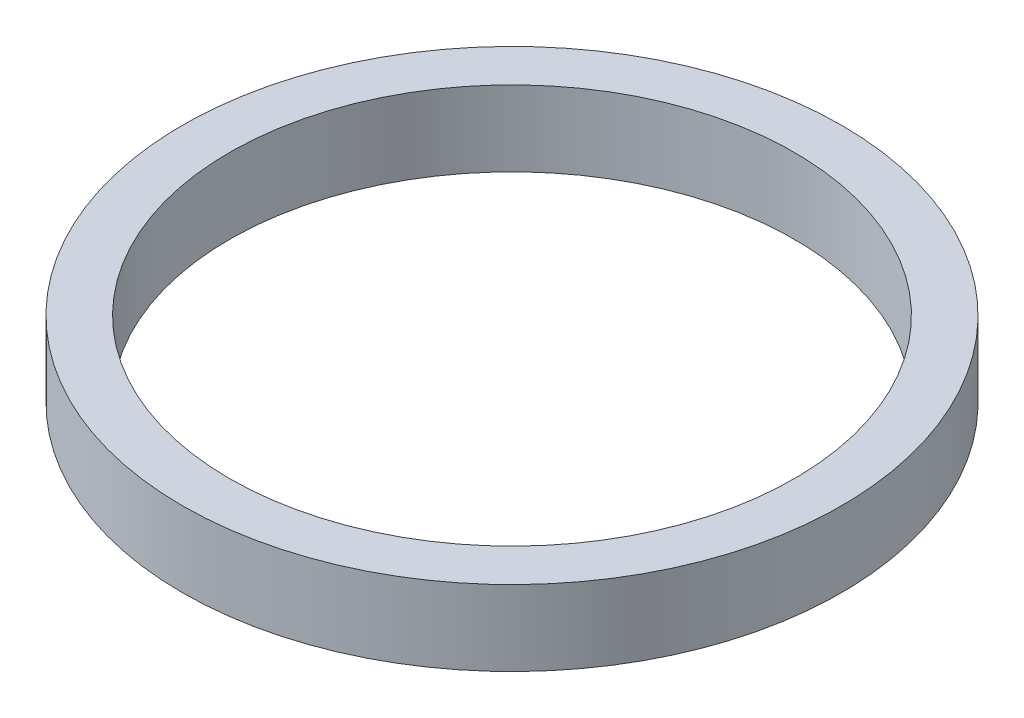
ISO-10303-21;
HEADER;
FILE_DESCRIPTION(('STEP AP214'),'2;1');
FILE_NAME('part.step','',(''),(''),'','','');
FILE_SCHEMA(('AUTOMOTIVE_DESIGN { 1 0 10303 214 1 1 1 1 }'));
ENDSEC;
DATA;
#1=APPLICATION_CONTEXT('core data for automotive mechanical design processes');
#2=APPLICATION_PROTOCOL_DEFINITION('international standard','automotive_design',2000,#1);
#3=PRODUCT_CONTEXT('',#1,'mechanical');
#4=PRODUCT('Part','Part','',(#3));
#5=PRODUCT_RELATED_PRODUCT_CATEGORY('part','',(#4));
#6=PRODUCT_DEFINITION_FORMATION('','',#4);
#7=PRODUCT_DEFINITION_CONTEXT('part definition',#1,'design');
#8=PRODUCT_DEFINITION('design','',#6,#7);
#9=PRODUCT_DEFINITION_SHAPE('','',#8);
#10=(LENGTH_UNIT() NAMED_UNIT(*) SI_UNIT(.MILLI.,.METRE.));
#11=(NAMED_UNIT(*) PLANE_ANGLE_UNIT() SI_UNIT($,.RADIAN.));
#12=(NAMED_UNIT(*) SI_UNIT($,.STERADIAN.) SOLID_ANGLE_UNIT());
#13=UNCERTAINTY_MEASURE_WITH_UNIT(LENGTH_MEASURE(1.E-05),#10,'distance_accuracy_value','');
#14=(GEOMETRIC_REPRESENTATION_CONTEXT(3) GLOBAL_UNCERTAINTY_ASSIGNED_CONTEXT((#13)) GLOBAL_UNIT_ASSIGNED_CONTEXT((#10,
#11,#12)) REPRESENTATION_CONTEXT('',''));
#15=CARTESIAN_POINT('',(0.,0.,0.));
#16=DIRECTION('',(0.,0.,1.));
#17=DIRECTION('',(1.,0.,0.));
#18=AXIS2_PLACEMENT_3D('',#15,#16,#17);
#19=CARTESIAN_POINT('',(0.,12.,0.));
#20=DIRECTION('',(0.,-1.,0.));
#21=DIRECTION('',(0.,0.,-1.));
#22=AXIS2_PLACEMENT_3D('',#19,#20,#21);
#23=CYLINDRICAL_SURFACE('',#22,52.5);
#24=CARTESIAN_POINT('',(0.,12.,0.));
#25=DIRECTION('',(0.,1.,0.));
#26=DIRECTION('',(0.,0.,1.));
#27=AXIS2_PLACEMENT_3D('',#24,#25,#26);
#28=CIRCLE('',#27,52.5);
#29=CARTESIAN_POINT('',(0.,12.,52.5));
#30=VERTEX_POINT('',#29);
#31=EDGE_CURVE('E10',#30,#30,#28,.T.);
#32=ORIENTED_EDGE('',*,*,#31,.F.);
#33=EDGE_LOOP('',(#32));
#34=FACE_BOUND('',#33,.T.);
#35=CARTESIAN_POINT('',(0.,0.,0.));
#36=DIRECTION('',(0.,1.,0.));
#37=DIRECTION('',(0.,0.,1.));
#38=AXIS2_PLACEMENT_3D('',#35,#36,#37);
#39=CIRCLE('',#38,52.5);
#40=CARTESIAN_POINT('',(0.,0.,52.5));
#41=VERTEX_POINT('',#40);
#42=EDGE_CURVE('E37',#41,#41,#39,.T.);
#43=ORIENTED_EDGE('',*,*,#42,.T.);
#44=EDGE_LOOP('',(#43));
#45=FACE_BOUND('',#44,.T.);
#46=ADVANCED_FACE('F40',(#34,#45),#23,.T.);
#47=CARTESIAN_POINT('',(0.,12.,0.));
#48=DIRECTION('',(0.,1.,0.));
#49=DIRECTION('',(0.,0.,1.));
#50=AXIS2_PLACEMENT_3D('',#47,#48,#49);
#51=PLANE('',#50);
#52=CARTESIAN_POINT('',(0.,12.,0.));
#53=DIRECTION('',(0.,1.,0.));
#54=DIRECTION('',(0.,0.,1.));
#55=AXIS2_PLACEMENT_3D('',#52,#53,#54);
#56=CIRCLE('',#55,45.);
#57=CARTESIAN_POINT('',(0.,12.,45.));
#58=VERTEX_POINT('',#57);
#59=EDGE_CURVE('E50',#58,#58,#56,.T.);
#60=ORIENTED_EDGE('',*,*,#59,.F.);
#61=EDGE_LOOP('',(#60));
#62=FACE_BOUND('',#61,.T.);
#63=ORIENTED_EDGE('',*,*,#31,.T.);
#64=EDGE_LOOP('',(#63));
#65=FACE_BOUND('',#64,.T.);
#66=ADVANCED_FACE('F59',(#62,#65),#51,.T.);
#67=CARTESIAN_POINT('',(0.,0.,0.));
#68=DIRECTION('',(0.,1.,0.));
#69=DIRECTION('',(0.,0.,1.));
#70=AXIS2_PLACEMENT_3D('',#67,#68,#69);
#71=PLANE('',#70);
#72=CARTESIAN_POINT('',(0.,0.,0.));
#73=DIRECTION('',(0.,1.,0.));
#74=DIRECTION('',(0.,0.,1.));
#75=AXIS2_PLACEMENT_3D('',#72,#73,#74);
#76=CIRCLE('',#75,45.);
#77=CARTESIAN_POINT('',(0.,0.,45.));
#78=VERTEX_POINT('',#77);
#79=EDGE_CURVE('E47',#78,#78,#76,.T.);
#80=ORIENTED_EDGE('',*,*,#79,.T.);
#81=EDGE_LOOP('',(#80));
#82=FACE_BOUND('',#81,.T.);
#83=ORIENTED_EDGE('',*,*,#42,.F.);
#84=EDGE_LOOP('',(#83));
#85=FACE_BOUND('',#84,.T.);
#86=ADVANCED_FACE('F58',(#82,#85),#71,.F.);
#87=CARTESIAN_POINT('',(0.,12.,0.));
#88=DIRECTION('',(0.,-1.,0.));
#89=DIRECTION('',(0.,0.,-1.));
#90=AXIS2_PLACEMENT_3D('',#87,#88,#89);
#91=CYLINDRICAL_SURFACE('',#90,45.);
#92=ORIENTED_EDGE('',*,*,#59,.T.);
#93=EDGE_LOOP('',(#92));
#94=FACE_BOUND('',#93,.T.);
#95=ORIENTED_EDGE('',*,*,#79,.F.);
#96=EDGE_LOOP('',(#95));
#97=FACE_BOUND('',#96,.T.);
#98=ADVANCED_FACE('F54',(#94,#97),#91,.F.);
#99=CLOSED_SHELL('',(#46,#66,#86,#98));
#100=MANIFOLD_SOLID_BREP('B2',#99);
#101=ADVANCED_BREP_SHAPE_REPRESENTATION('',(#18,#100),#14);
#102=SHAPE_DEFINITION_REPRESENTATION(#9,#101);
ENDSEC;
END-ISO-10303-21;
